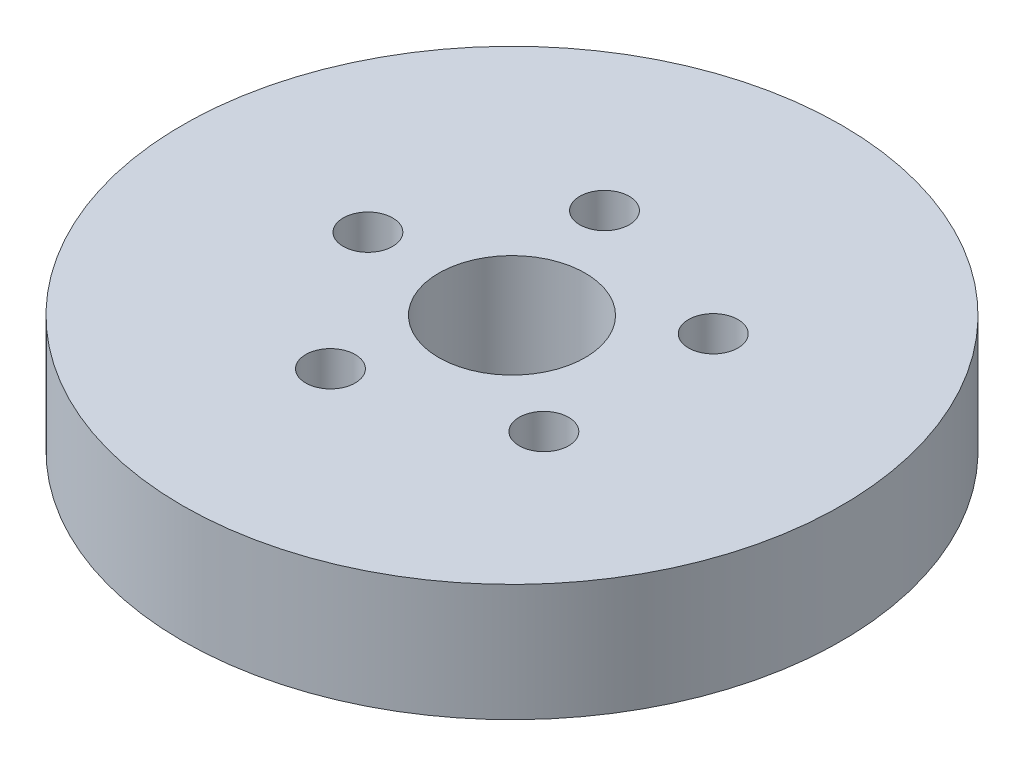
ISO-10303-21;
HEADER;
FILE_DESCRIPTION(('STEP AP214'),'2;1');
FILE_NAME('part.step','',(''),(''),'','','');
FILE_SCHEMA(('AUTOMOTIVE_DESIGN { 1 0 10303 214 1 1 1 1 }'));
ENDSEC;
DATA;
#1=APPLICATION_CONTEXT('core data for automotive mechanical design processes');
#2=APPLICATION_PROTOCOL_DEFINITION('international standard','automotive_design',2000,#1);
#3=PRODUCT_CONTEXT('',#1,'mechanical');
#4=PRODUCT('Part','Part','',(#3));
#5=PRODUCT_RELATED_PRODUCT_CATEGORY('part','',(#4));
#6=PRODUCT_DEFINITION_FORMATION('','',#4);
#7=PRODUCT_DEFINITION_CONTEXT('part definition',#1,'design');
#8=PRODUCT_DEFINITION('design','',#6,#7);
#9=PRODUCT_DEFINITION_SHAPE('','',#8);
#10=(LENGTH_UNIT() NAMED_UNIT(*) SI_UNIT(.MILLI.,.METRE.));
#11=(NAMED_UNIT(*) PLANE_ANGLE_UNIT() SI_UNIT($,.RADIAN.));
#12=(NAMED_UNIT(*) SI_UNIT($,.STERADIAN.) SOLID_ANGLE_UNIT());
#13=UNCERTAINTY_MEASURE_WITH_UNIT(LENGTH_MEASURE(1.E-05),#10,'distance_accuracy_value','');
#14=(GEOMETRIC_REPRESENTATION_CONTEXT(3) GLOBAL_UNCERTAINTY_ASSIGNED_CONTEXT((#13)) GLOBAL_UNIT_ASSIGNED_CONTEXT((#10,
#11,#12)) REPRESENTATION_CONTEXT('',''));
#15=CARTESIAN_POINT('',(0.,0.,0.));
#16=DIRECTION('',(0.,0.,1.));
#17=DIRECTION('',(1.,0.,0.));
#18=AXIS2_PLACEMENT_3D('',#15,#16,#17);
#19=CARTESIAN_POINT('',(0.,24.,0.));
#20=DIRECTION('',(0.,-1.,0.));
#21=DIRECTION('',(0.,0.,-1.));
#22=AXIS2_PLACEMENT_3D('',#19,#20,#21);
#23=CYLINDRICAL_SURFACE('',#22,67.5);
#24=CARTESIAN_POINT('',(0.,24.,0.));
#25=DIRECTION('',(0.,1.,0.));
#26=DIRECTION('',(0.,0.,1.));
#27=AXIS2_PLACEMENT_3D('',#24,#25,#26);
#28=CIRCLE('',#27,67.5);
#29=CARTESIAN_POINT('',(0.,24.,67.5));
#30=VERTEX_POINT('',#29);
#31=EDGE_CURVE('E10',#30,#30,#28,.T.);
#32=ORIENTED_EDGE('',*,*,#31,.F.);
#33=EDGE_LOOP('',(#32));
#34=FACE_BOUND('',#33,.T.);
#35=CARTESIAN_POINT('',(0.,0.,0.));
#36=DIRECTION('',(0.,1.,0.));
#37=DIRECTION('',(0.,0.,1.));
#38=AXIS2_PLACEMENT_3D('',#35,#36,#37);
#39=CIRCLE('',#38,67.5);
#40=CARTESIAN_POINT('',(0.,0.,67.5));
#41=VERTEX_POINT('',#40);
#42=EDGE_CURVE('E37',#41,#41,#39,.T.);
#43=ORIENTED_EDGE('',*,*,#42,.T.);
#44=EDGE_LOOP('',(#43));
#45=FACE_BOUND('',#44,.T.);
#46=ADVANCED_FACE('F40',(#34,#45),#23,.T.);
#47=CARTESIAN_POINT('',(0.,24.,0.));
#48=DIRECTION('',(0.,1.,0.));
#49=DIRECTION('',(0.,0.,1.));
#50=AXIS2_PLACEMENT_3D('',#47,#48,#49);
#51=PLANE('',#50);
#52=CARTESIAN_POINT('',(-9.11947320850556,24.,28.0668525615286));
#53=DIRECTION('',(0.,1.,0.));
#54=DIRECTION('',(0.951056516295155,0.,0.309016994374945));
#55=AXIS2_PLACEMENT_3D('',#52,#53,#54);
#56=CIRCLE('',#55,5.06534923069204);
#57=CARTESIAN_POINT('',(-4.30203981534524,24.,29.6321315562565));
#58=VERTEX_POINT('',#57);
#59=EDGE_CURVE('E78',#58,#58,#56,.T.);
#60=ORIENTED_EDGE('',*,*,#59,.F.);
#61=EDGE_LOOP('',(#60));
#62=FACE_BOUND('',#61,.T.);
#63=CARTESIAN_POINT('',(23.8750908193619,24.,17.3462688402566));
#64=DIRECTION('',(0.,1.,0.));
#65=DIRECTION('',(0.587785252292469,0.,-0.809016994374951));
#66=AXIS2_PLACEMENT_3D('',#63,#64,#65);
#67=CIRCLE('',#66,5.06534923069204);
#68=CARTESIAN_POINT('',(26.8524283948737,24.,13.2483152301826));
#69=VERTEX_POINT('',#68);
#70=EDGE_CURVE('E71',#69,#69,#67,.T.);
#71=ORIENTED_EDGE('',*,*,#70,.F.);
#72=EDGE_LOOP('',(#71));
#73=FACE_BOUND('',#72,.T.);
#74=CARTESIAN_POINT('',(23.8750908193617,24.,-17.3462688402569));
#75=DIRECTION('',(0.,1.,0.));
#76=DIRECTION('',(-0.58778525229248,0.,-0.809016994374942));
#77=AXIS2_PLACEMENT_3D('',#74,#75,#76);
#78=CIRCLE('',#77,5.06534923069204);
#79=CARTESIAN_POINT('',(20.8977532438498,24.,-21.4442224503308));
#80=VERTEX_POINT('',#79);
#81=EDGE_CURVE('E70',#80,#80,#78,.T.);
#82=ORIENTED_EDGE('',*,*,#81,.F.);
#83=EDGE_LOOP('',(#82));
#84=FACE_BOUND('',#83,.T.);
#85=CARTESIAN_POINT('',(-9.11947320850595,24.,-28.0668525615285));
#86=DIRECTION('',(0.,1.,0.));
#87=DIRECTION('',(-0.95105651629515,0.,0.309016994374958));
#88=AXIS2_PLACEMENT_3D('',#85,#86,#87);
#89=CIRCLE('',#88,5.06534923069204);
#90=CARTESIAN_POINT('',(-13.9369066016662,24.,-26.5015735668005));
#91=VERTEX_POINT('',#90);
#92=EDGE_CURVE('E61',#91,#91,#89,.T.);
#93=ORIENTED_EDGE('',*,*,#92,.F.);
#94=EDGE_LOOP('',(#93));
#95=FACE_BOUND('',#94,.T.);
#96=CARTESIAN_POINT('',(-29.5112352217124,24.,0.));
#97=DIRECTION('',(0.,1.,0.));
#98=DIRECTION('',(0.,0.,1.));
#99=AXIS2_PLACEMENT_3D('',#96,#97,#98);
#100=CIRCLE('',#99,5.06534923069204);
#101=CARTESIAN_POINT('',(-29.5112352217124,24.,5.06534923069204));
#102=VERTEX_POINT('',#101);
#103=EDGE_CURVE('E54',#102,#102,#100,.T.);
#104=ORIENTED_EDGE('',*,*,#103,.F.);
#105=EDGE_LOOP('',(#104));
#106=FACE_BOUND('',#105,.T.);
#107=CARTESIAN_POINT('',(0.,24.,0.));
#108=DIRECTION('',(0.,1.,0.));
#109=DIRECTION('',(0.,0.,1.));
#110=AXIS2_PLACEMENT_3D('',#107,#108,#109);
#111=CIRCLE('',#110,15.);
#112=CARTESIAN_POINT('',(0.,24.,15.));
#113=VERTEX_POINT('',#112);
#114=EDGE_CURVE('E50',#113,#113,#111,.T.);
#115=ORIENTED_EDGE('',*,*,#114,.F.);
#116=EDGE_LOOP('',(#115));
#117=FACE_BOUND('',#116,.T.);
#118=ORIENTED_EDGE('',*,*,#31,.T.);
#119=EDGE_LOOP('',(#118));
#120=FACE_BOUND('',#119,.T.);
#121=ADVANCED_FACE('F94',(#62,#73,#84,#95,#106,#117,#120),#51,.T.);
#122=CARTESIAN_POINT('',(0.,0.,0.));
#123=DIRECTION('',(0.,1.,0.));
#124=DIRECTION('',(0.,0.,1.));
#125=AXIS2_PLACEMENT_3D('',#122,#123,#124);
#126=PLANE('',#125);
#127=CARTESIAN_POINT('',(0.,0.,0.));
#128=DIRECTION('',(0.,1.,0.));
#129=DIRECTION('',(0.,0.,1.));
#130=AXIS2_PLACEMENT_3D('',#127,#128,#129);
#131=CIRCLE('',#130,15.);
#132=CARTESIAN_POINT('',(0.,0.,15.));
#133=VERTEX_POINT('',#132);
#134=EDGE_CURVE('E47',#133,#133,#131,.T.);
#135=ORIENTED_EDGE('',*,*,#134,.T.);
#136=EDGE_LOOP('',(#135));
#137=FACE_BOUND('',#136,.T.);
#138=ORIENTED_EDGE('',*,*,#42,.F.);
#139=EDGE_LOOP('',(#138));
#140=FACE_BOUND('',#139,.T.);
#141=ADVANCED_FACE('F100',(#137,#140),#126,.F.);
#142=CARTESIAN_POINT('',(0.,24.,0.));
#143=DIRECTION('',(0.,-1.,0.));
#144=DIRECTION('',(0.,0.,-1.));
#145=AXIS2_PLACEMENT_3D('',#142,#143,#144);
#146=CYLINDRICAL_SURFACE('',#145,15.);
#147=ORIENTED_EDGE('',*,*,#114,.T.);
#148=EDGE_LOOP('',(#147));
#149=FACE_BOUND('',#148,.T.);
#150=ORIENTED_EDGE('',*,*,#134,.F.);
#151=EDGE_LOOP('',(#150));
#152=FACE_BOUND('',#151,.T.);
#153=ADVANCED_FACE('F108',(#149,#152),#146,.F.);
#154=CARTESIAN_POINT('',(-29.5112352217124,2.5183973022626,0.));
#155=DIRECTION('',(0.,1.,0.));
#156=DIRECTION('',(0.,0.,1.));
#157=AXIS2_PLACEMENT_3D('',#154,#155,#156);
#158=CYLINDRICAL_SURFACE('',#157,5.06534923069204);
#159=CARTESIAN_POINT('',(-29.5112352217124,2.5183973022626,0.));
#160=DIRECTION('',(0.,1.,0.));
#161=DIRECTION('',(0.,0.,1.));
#162=AXIS2_PLACEMENT_3D('',#159,#160,#161);
#163=CIRCLE('',#162,5.06534923069204);
#164=CARTESIAN_POINT('',(-29.5112352217124,2.5183973022626,5.06534923069204));
#165=VERTEX_POINT('',#164);
#166=EDGE_CURVE('E55',#165,#165,#163,.T.);
#167=ORIENTED_EDGE('',*,*,#166,.F.);
#168=EDGE_LOOP('',(#167));
#169=FACE_BOUND('',#168,.T.);
#170=ORIENTED_EDGE('',*,*,#103,.T.);
#171=EDGE_LOOP('',(#170));
#172=FACE_BOUND('',#171,.T.);
#173=ADVANCED_FACE('F115',(#169,#172),#158,.F.);
#174=CARTESIAN_POINT('',(-29.5112352217124,2.5183973022626,0.));
#175=DIRECTION('',(0.,1.,0.));
#176=DIRECTION('',(0.,0.,1.));
#177=AXIS2_PLACEMENT_3D('',#174,#175,#176);
#178=PLANE('',#177);
#179=ORIENTED_EDGE('',*,*,#166,.T.);
#180=EDGE_LOOP('',(#179));
#181=FACE_BOUND('',#180,.T.);
#182=ADVANCED_FACE('F142',(#181),#178,.T.);
#183=CARTESIAN_POINT('',(-9.11947320850595,2.5183973022626,-28.0668525615285));
#184=DIRECTION('',(0.,1.,0.));
#185=DIRECTION('',(0.,0.,1.));
#186=AXIS2_PLACEMENT_3D('',#183,#184,#185);
#187=CYLINDRICAL_SURFACE('',#186,5.06534923069204);
#188=CARTESIAN_POINT('',(-9.11947320850595,2.5183973022626,-28.0668525615285));
#189=DIRECTION('',(0.,1.,0.));
#190=DIRECTION('',(-0.95105651629515,0.,0.309016994374958));
#191=AXIS2_PLACEMENT_3D('',#188,#189,#190);
#192=CIRCLE('',#191,5.06534923069204);
#193=CARTESIAN_POINT('',(-13.9369066016662,2.5183973022626,-26.5015735668005));
#194=VERTEX_POINT('',#193);
#195=EDGE_CURVE('E63',#194,#194,#192,.T.);
#196=ORIENTED_EDGE('',*,*,#195,.F.);
#197=EDGE_LOOP('',(#196));
#198=FACE_BOUND('',#197,.T.);
#199=ORIENTED_EDGE('',*,*,#92,.T.);
#200=EDGE_LOOP('',(#199));
#201=FACE_BOUND('',#200,.T.);
#202=ADVANCED_FACE('F147',(#198,#201),#187,.F.);
#203=CARTESIAN_POINT('',(-9.11947320850595,2.5183973022626,-28.0668525615285));
#204=DIRECTION('',(0.,1.,0.));
#205=DIRECTION('',(-0.95105651629515,0.,0.309016994374958));
#206=AXIS2_PLACEMENT_3D('',#203,#204,#205);
#207=PLANE('',#206);
#208=ORIENTED_EDGE('',*,*,#195,.T.);
#209=EDGE_LOOP('',(#208));
#210=FACE_BOUND('',#209,.T.);
#211=ADVANCED_FACE('F163',(#210),#207,.T.);
#212=CARTESIAN_POINT('',(23.8750908193617,2.5183973022626,-17.3462688402569));
#213=DIRECTION('',(0.,1.,0.));
#214=DIRECTION('',(0.,0.,1.));
#215=AXIS2_PLACEMENT_3D('',#212,#213,#214);
#216=CYLINDRICAL_SURFACE('',#215,5.06534923069204);
#217=CARTESIAN_POINT('',(23.8750908193617,2.5183973022626,-17.3462688402569));
#218=DIRECTION('',(0.,1.,0.));
#219=DIRECTION('',(-0.58778525229248,0.,-0.809016994374942));
#220=AXIS2_PLACEMENT_3D('',#217,#218,#219);
#221=CIRCLE('',#220,5.06534923069204);
#222=CARTESIAN_POINT('',(20.8977532438498,2.5183973022626,-21.4442224503308));
#223=VERTEX_POINT('',#222);
#224=EDGE_CURVE('E69',#223,#223,#221,.T.);
#225=ORIENTED_EDGE('',*,*,#224,.F.);
#226=EDGE_LOOP('',(#225));
#227=FACE_BOUND('',#226,.T.);
#228=ORIENTED_EDGE('',*,*,#81,.T.);
#229=EDGE_LOOP('',(#228));
#230=FACE_BOUND('',#229,.T.);
#231=ADVANCED_FACE('F172',(#227,#230),#216,.F.);
#232=CARTESIAN_POINT('',(23.8750908193617,2.5183973022626,-17.3462688402569));
#233=DIRECTION('',(0.,1.,0.));
#234=DIRECTION('',(-0.58778525229248,0.,-0.809016994374942));
#235=AXIS2_PLACEMENT_3D('',#232,#233,#234);
#236=PLANE('',#235);
#237=ORIENTED_EDGE('',*,*,#224,.T.);
#238=EDGE_LOOP('',(#237));
#239=FACE_BOUND('',#238,.T.);
#240=ADVANCED_FACE('F185',(#239),#236,.T.);
#241=CARTESIAN_POINT('',(23.8750908193619,2.5183973022626,17.3462688402566));
#242=DIRECTION('',(0.,1.,0.));
#243=DIRECTION('',(0.,0.,1.));
#244=AXIS2_PLACEMENT_3D('',#241,#242,#243);
#245=CYLINDRICAL_SURFACE('',#244,5.06534923069204);
#246=CARTESIAN_POINT('',(23.8750908193619,2.5183973022626,17.3462688402566));
#247=DIRECTION('',(0.,1.,0.));
#248=DIRECTION('',(0.587785252292469,0.,-0.809016994374951));
#249=AXIS2_PLACEMENT_3D('',#246,#247,#248);
#250=CIRCLE('',#249,5.06534923069204);
#251=CARTESIAN_POINT('',(26.8524283948737,2.5183973022626,13.2483152301826));
#252=VERTEX_POINT('',#251);
#253=EDGE_CURVE('E76',#252,#252,#250,.T.);
#254=ORIENTED_EDGE('',*,*,#253,.F.);
#255=EDGE_LOOP('',(#254));
#256=FACE_BOUND('',#255,.T.);
#257=ORIENTED_EDGE('',*,*,#70,.T.);
#258=EDGE_LOOP('',(#257));
#259=FACE_BOUND('',#258,.T.);
#260=ADVANCED_FACE('F191',(#256,#259),#245,.F.);
#261=CARTESIAN_POINT('',(23.8750908193619,2.5183973022626,17.3462688402566));
#262=DIRECTION('',(0.,1.,0.));
#263=DIRECTION('',(0.587785252292469,0.,-0.809016994374951));
#264=AXIS2_PLACEMENT_3D('',#261,#262,#263);
#265=PLANE('',#264);
#266=ORIENTED_EDGE('',*,*,#253,.T.);
#267=EDGE_LOOP('',(#266));
#268=FACE_BOUND('',#267,.T.);
#269=ADVANCED_FACE('F89',(#268),#265,.T.);
#270=CARTESIAN_POINT('',(-9.11947320850556,2.5183973022626,28.0668525615286));
#271=DIRECTION('',(0.,1.,0.));
#272=DIRECTION('',(0.,0.,1.));
#273=AXIS2_PLACEMENT_3D('',#270,#271,#272);
#274=CYLINDRICAL_SURFACE('',#273,5.06534923069204);
#275=CARTESIAN_POINT('',(-9.11947320850556,2.5183973022626,28.0668525615286));
#276=DIRECTION('',(0.,1.,0.));
#277=DIRECTION('',(0.951056516295155,0.,0.309016994374945));
#278=AXIS2_PLACEMENT_3D('',#275,#276,#277);
#279=CIRCLE('',#278,5.06534923069204);
#280=CARTESIAN_POINT('',(-4.30203981534524,2.5183973022626,29.6321315562565));
#281=VERTEX_POINT('',#280);
#282=EDGE_CURVE('E59',#281,#281,#279,.T.);
#283=ORIENTED_EDGE('',*,*,#282,.F.);
#284=EDGE_LOOP('',(#283));
#285=FACE_BOUND('',#284,.T.);
#286=ORIENTED_EDGE('',*,*,#59,.T.);
#287=EDGE_LOOP('',(#286));
#288=FACE_BOUND('',#287,.T.);
#289=ADVANCED_FACE('F87',(#285,#288),#274,.F.);
#290=CARTESIAN_POINT('',(-9.11947320850556,2.5183973022626,28.0668525615286));
#291=DIRECTION('',(0.,1.,0.));
#292=DIRECTION('',(0.951056516295155,0.,0.309016994374945));
#293=AXIS2_PLACEMENT_3D('',#290,#291,#292);
#294=PLANE('',#293);
#295=ORIENTED_EDGE('',*,*,#282,.T.);
#296=EDGE_LOOP('',(#295));
#297=FACE_BOUND('',#296,.T.);
#298=ADVANCED_FACE('F84',(#297),#294,.T.);
#299=CLOSED_SHELL('',(#46,#121,#141,#153,#173,#182,#202,#211,#231,#240,#260,#269,#289,#298));
#300=MANIFOLD_SOLID_BREP('B2',#299);
#301=ADVANCED_BREP_SHAPE_REPRESENTATION('',(#18,#300),#14);
#302=SHAPE_DEFINITION_REPRESENTATION(#9,#301);
ENDSEC;
END-ISO-10303-21;
